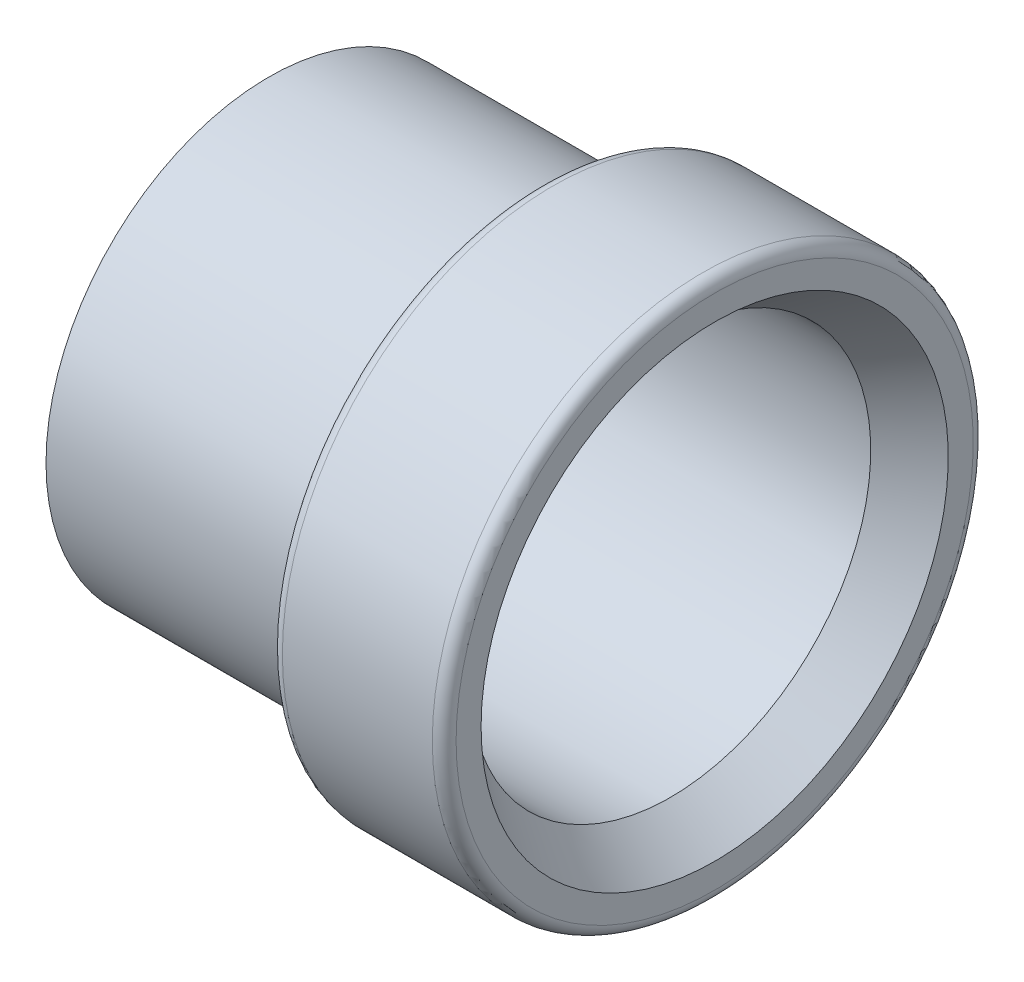
ISO-10303-21;
HEADER;
FILE_DESCRIPTION(('STEP AP214'),'2;1');
FILE_NAME('part.step','',(''),(''),'','','');
FILE_SCHEMA(('AUTOMOTIVE_DESIGN { 1 0 10303 214 1 1 1 1 }'));
ENDSEC;
DATA;
#1=APPLICATION_CONTEXT('core data for automotive mechanical design processes');
#2=APPLICATION_PROTOCOL_DEFINITION('international standard','automotive_design',2000,#1);
#3=PRODUCT_CONTEXT('',#1,'mechanical');
#4=PRODUCT('Part','Part','',(#3));
#5=PRODUCT_RELATED_PRODUCT_CATEGORY('part','',(#4));
#6=PRODUCT_DEFINITION_FORMATION('','',#4);
#7=PRODUCT_DEFINITION_CONTEXT('part definition',#1,'design');
#8=PRODUCT_DEFINITION('design','',#6,#7);
#9=PRODUCT_DEFINITION_SHAPE('','',#8);
#10=(LENGTH_UNIT() NAMED_UNIT(*) SI_UNIT(.MILLI.,.METRE.));
#11=(NAMED_UNIT(*) PLANE_ANGLE_UNIT() SI_UNIT($,.RADIAN.));
#12=(NAMED_UNIT(*) SI_UNIT($,.STERADIAN.) SOLID_ANGLE_UNIT());
#13=UNCERTAINTY_MEASURE_WITH_UNIT(LENGTH_MEASURE(1.E-05),#10,'distance_accuracy_value','');
#14=(GEOMETRIC_REPRESENTATION_CONTEXT(3) GLOBAL_UNCERTAINTY_ASSIGNED_CONTEXT((#13)) GLOBAL_UNIT_ASSIGNED_CONTEXT((#10,
#11,#12)) REPRESENTATION_CONTEXT('',''));
#15=CARTESIAN_POINT('',(0.,0.,0.));
#16=DIRECTION('',(0.,0.,1.));
#17=DIRECTION('',(1.,0.,0.));
#18=AXIS2_PLACEMENT_3D('',#15,#16,#17);
#19=CARTESIAN_POINT('',(-7.1374,6.4135,0.));
#20=DIRECTION('',(1.,0.,0.));
#21=DIRECTION('',(0.,0.,-1.));
#22=AXIS2_PLACEMENT_3D('',#19,#20,#21);
#23=PLANE('',#22);
#24=CARTESIAN_POINT('',(-7.1374,0.,0.));
#25=DIRECTION('',(-1.,0.,0.));
#26=DIRECTION('',(0.,0.,1.));
#27=AXIS2_PLACEMENT_3D('',#24,#25,#26);
#28=CIRCLE('',#27,6.4135);
#29=CARTESIAN_POINT('',(-7.1374,0.,6.4135));
#30=VERTEX_POINT('',#29);
#31=EDGE_CURVE('E10',#30,#30,#28,.T.);
#32=ORIENTED_EDGE('',*,*,#31,.F.);
#33=EDGE_LOOP('',(#32));
#34=FACE_BOUND('',#33,.T.);
#35=CARTESIAN_POINT('',(-7.1374,0.,0.));
#36=DIRECTION('',(-1.,0.,0.));
#37=DIRECTION('',(0.,0.,1.));
#38=AXIS2_PLACEMENT_3D('',#35,#36,#37);
#39=CIRCLE('',#38,7.1374);
#40=CARTESIAN_POINT('',(-7.1374,0.,7.1374));
#41=VERTEX_POINT('',#40);
#42=EDGE_CURVE('E61',#41,#41,#39,.T.);
#43=ORIENTED_EDGE('',*,*,#42,.T.);
#44=EDGE_LOOP('',(#43));
#45=FACE_BOUND('',#44,.T.);
#46=ADVANCED_FACE('F30',(#34,#45),#23,.F.);
#47=CARTESIAN_POINT('',(-7.1374,0.,0.));
#48=DIRECTION('',(-1.,0.,0.));
#49=DIRECTION('',(0.,0.,1.));
#50=AXIS2_PLACEMENT_3D('',#47,#48,#49);
#51=CYLINDRICAL_SURFACE('',#50,6.4135);
#52=CARTESIAN_POINT('',(5.72170858429535,0.,0.));
#53=DIRECTION('',(-1.,0.,0.));
#54=DIRECTION('',(0.,0.,1.));
#55=AXIS2_PLACEMENT_3D('',#52,#53,#54);
#56=CIRCLE('',#55,6.4135);
#57=CARTESIAN_POINT('',(5.72170858429535,0.,6.4135));
#58=VERTEX_POINT('',#57);
#59=EDGE_CURVE('E36',#58,#58,#56,.T.);
#60=ORIENTED_EDGE('',*,*,#59,.F.);
#61=EDGE_LOOP('',(#60));
#62=FACE_BOUND('',#61,.T.);
#63=ORIENTED_EDGE('',*,*,#31,.T.);
#64=EDGE_LOOP('',(#63));
#65=FACE_BOUND('',#64,.T.);
#66=ADVANCED_FACE('F104',(#62,#65),#51,.F.);
#67=CARTESIAN_POINT('',(5.72170858429535,0.,0.));
#68=DIRECTION('',(1.,0.,0.));
#69=DIRECTION('',(0.,0.,-1.));
#70=AXIS2_PLACEMENT_3D('',#67,#68,#69);
#71=CONICAL_SURFACE('',#70,6.4135,0.645771823237904);
#72=CARTESIAN_POINT('',(7.1374,0.,0.));
#73=DIRECTION('',(-1.,0.,0.));
#74=DIRECTION('',(0.,0.,1.));
#75=AXIS2_PLACEMENT_3D('',#72,#73,#74);
#76=CIRCLE('',#75,7.4803);
#77=CARTESIAN_POINT('',(7.1374,0.,7.4803));
#78=VERTEX_POINT('',#77);
#79=EDGE_CURVE('E40',#78,#78,#76,.T.);
#80=ORIENTED_EDGE('',*,*,#79,.F.);
#81=EDGE_LOOP('',(#80));
#82=FACE_BOUND('',#81,.T.);
#83=ORIENTED_EDGE('',*,*,#59,.T.);
#84=EDGE_LOOP('',(#83));
#85=FACE_BOUND('',#84,.T.);
#86=ADVANCED_FACE('F99',(#82,#85),#71,.F.);
#87=CARTESIAN_POINT('',(7.1374,7.4803,0.));
#88=DIRECTION('',(-1.,0.,0.));
#89=DIRECTION('',(0.,0.,1.));
#90=AXIS2_PLACEMENT_3D('',#87,#88,#89);
#91=PLANE('',#90);
#92=CARTESIAN_POINT('',(7.1374,0.,0.));
#93=DIRECTION('',(-1.,0.,0.));
#94=DIRECTION('',(0.,0.,1.));
#95=AXIS2_PLACEMENT_3D('',#92,#93,#94);
#96=CIRCLE('',#95,8.2804);
#97=CARTESIAN_POINT('',(7.1374,0.,8.2804));
#98=VERTEX_POINT('',#97);
#99=EDGE_CURVE('E44',#98,#98,#96,.T.);
#100=ORIENTED_EDGE('',*,*,#99,.F.);
#101=EDGE_LOOP('',(#100));
#102=FACE_BOUND('',#101,.T.);
#103=ORIENTED_EDGE('',*,*,#79,.T.);
#104=EDGE_LOOP('',(#103));
#105=FACE_BOUND('',#104,.T.);
#106=ADVANCED_FACE('F93',(#102,#105),#91,.F.);
#107=CARTESIAN_POINT('',(6.7564,0.,0.));
#108=DIRECTION('',(-1.,0.,0.));
#109=DIRECTION('',(0.,0.,1.));
#110=AXIS2_PLACEMENT_3D('',#107,#108,#109);
#111=TOROIDAL_SURFACE('',#110,8.2804,0.381);
#112=CARTESIAN_POINT('',(6.7564,0.,0.));
#113=DIRECTION('',(-1.,0.,0.));
#114=DIRECTION('',(0.,0.,1.));
#115=AXIS2_PLACEMENT_3D('',#112,#113,#114);
#116=CIRCLE('',#115,8.6614);
#117=CARTESIAN_POINT('',(6.7564,0.,8.6614));
#118=VERTEX_POINT('',#117);
#119=EDGE_CURVE('E49',#118,#118,#116,.T.);
#120=ORIENTED_EDGE('',*,*,#119,.F.);
#121=EDGE_LOOP('',(#120));
#122=FACE_BOUND('',#121,.T.);
#123=ORIENTED_EDGE('',*,*,#99,.T.);
#124=EDGE_LOOP('',(#123));
#125=FACE_BOUND('',#124,.T.);
#126=ADVANCED_FACE('F87',(#122,#125),#111,.T.);
#127=CARTESIAN_POINT('',(-7.1374,0.,0.));
#128=DIRECTION('',(-1.,0.,0.));
#129=DIRECTION('',(0.,0.,1.));
#130=AXIS2_PLACEMENT_3D('',#127,#128,#129);
#131=CYLINDRICAL_SURFACE('',#130,8.6614);
#132=CARTESIAN_POINT('',(1.9558,0.,0.));
#133=DIRECTION('',(-1.,0.,0.));
#134=DIRECTION('',(0.,0.,1.));
#135=AXIS2_PLACEMENT_3D('',#132,#133,#134);
#136=CIRCLE('',#135,8.6614);
#137=CARTESIAN_POINT('',(1.9558,0.,8.6614));
#138=VERTEX_POINT('',#137);
#139=EDGE_CURVE('E52',#138,#138,#136,.T.);
#140=ORIENTED_EDGE('',*,*,#139,.F.);
#141=EDGE_LOOP('',(#140));
#142=FACE_BOUND('',#141,.T.);
#143=ORIENTED_EDGE('',*,*,#119,.T.);
#144=EDGE_LOOP('',(#143));
#145=FACE_BOUND('',#144,.T.);
#146=ADVANCED_FACE('F81',(#142,#145),#131,.T.);
#147=CARTESIAN_POINT('',(1.9558,0.,0.));
#148=DIRECTION('',(-1.,0.,0.));
#149=DIRECTION('',(0.,0.,1.));
#150=AXIS2_PLACEMENT_3D('',#147,#148,#149);
#151=TOROIDAL_SURFACE('',#150,8.2804,0.381);
#152=CARTESIAN_POINT('',(1.5748,0.,0.));
#153=DIRECTION('',(-1.,0.,0.));
#154=DIRECTION('',(0.,0.,1.));
#155=AXIS2_PLACEMENT_3D('',#152,#153,#154);
#156=CIRCLE('',#155,8.2804);
#157=CARTESIAN_POINT('',(1.5748,0.,8.2804));
#158=VERTEX_POINT('',#157);
#159=EDGE_CURVE('E55',#158,#158,#156,.T.);
#160=ORIENTED_EDGE('',*,*,#159,.F.);
#161=EDGE_LOOP('',(#160));
#162=FACE_BOUND('',#161,.T.);
#163=ORIENTED_EDGE('',*,*,#139,.T.);
#164=EDGE_LOOP('',(#163));
#165=FACE_BOUND('',#164,.T.);
#166=ADVANCED_FACE('F75',(#162,#165),#151,.T.);
#167=CARTESIAN_POINT('',(1.5748,8.2804,0.));
#168=DIRECTION('',(1.,0.,0.));
#169=DIRECTION('',(0.,0.,-1.));
#170=AXIS2_PLACEMENT_3D('',#167,#168,#169);
#171=PLANE('',#170);
#172=CARTESIAN_POINT('',(1.5748,0.,0.));
#173=DIRECTION('',(-1.,0.,0.));
#174=DIRECTION('',(0.,0.,1.));
#175=AXIS2_PLACEMENT_3D('',#172,#173,#174);
#176=CIRCLE('',#175,7.1374);
#177=CARTESIAN_POINT('',(1.5748,0.,7.1374));
#178=VERTEX_POINT('',#177);
#179=EDGE_CURVE('E58',#178,#178,#176,.T.);
#180=ORIENTED_EDGE('',*,*,#179,.F.);
#181=EDGE_LOOP('',(#180));
#182=FACE_BOUND('',#181,.T.);
#183=ORIENTED_EDGE('',*,*,#159,.T.);
#184=EDGE_LOOP('',(#183));
#185=FACE_BOUND('',#184,.T.);
#186=ADVANCED_FACE('F69',(#182,#185),#171,.F.);
#187=CARTESIAN_POINT('',(-7.1374,0.,0.));
#188=DIRECTION('',(-1.,0.,0.));
#189=DIRECTION('',(0.,0.,1.));
#190=AXIS2_PLACEMENT_3D('',#187,#188,#189);
#191=CYLINDRICAL_SURFACE('',#190,7.1374);
#192=ORIENTED_EDGE('',*,*,#42,.F.);
#193=EDGE_LOOP('',(#192));
#194=FACE_BOUND('',#193,.T.);
#195=ORIENTED_EDGE('',*,*,#179,.T.);
#196=EDGE_LOOP('',(#195));
#197=FACE_BOUND('',#196,.T.);
#198=ADVANCED_FACE('F66',(#194,#197),#191,.T.);
#199=CLOSED_SHELL('',(#46,#66,#86,#106,#126,#146,#166,#186,#198));
#200=MANIFOLD_SOLID_BREP('B2',#199);
#201=ADVANCED_BREP_SHAPE_REPRESENTATION('',(#18,#200),#14);
#202=SHAPE_DEFINITION_REPRESENTATION(#9,#201);
ENDSEC;
END-ISO-10303-21;
